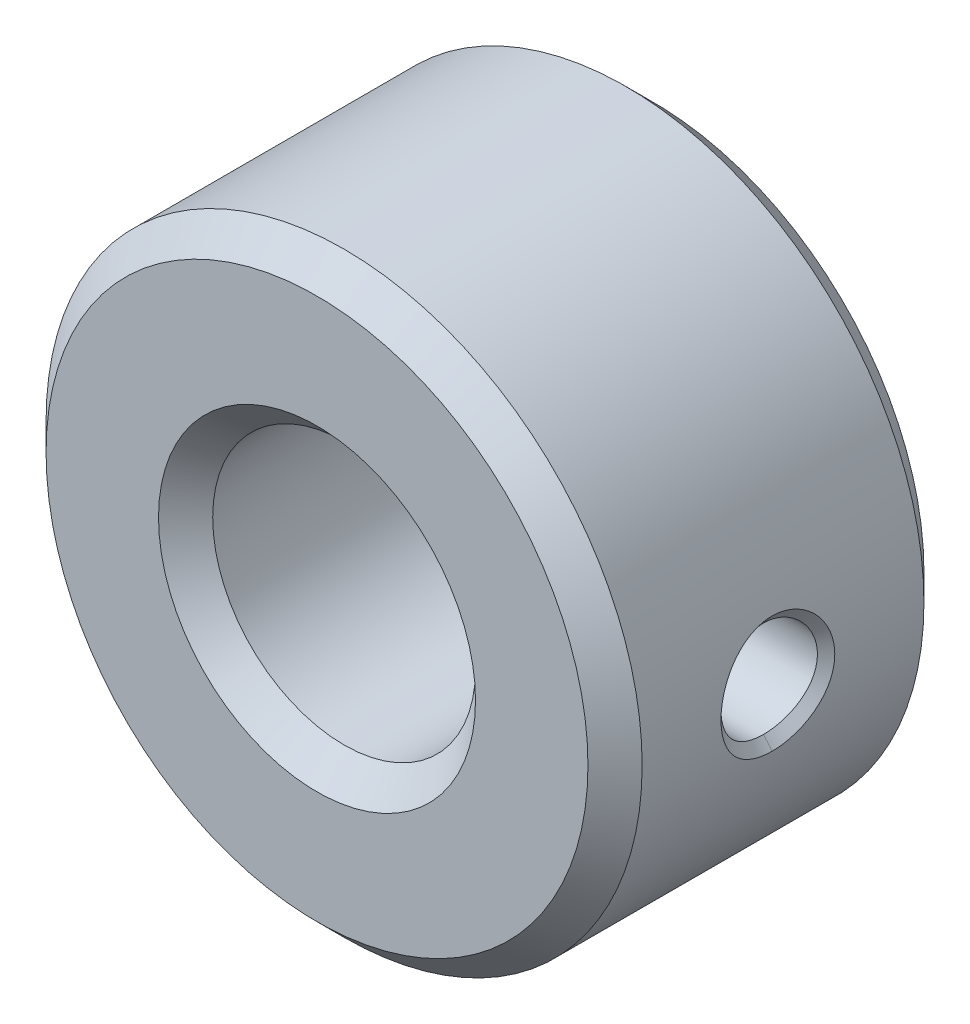
ISO-10303-21;
HEADER;
FILE_DESCRIPTION(('STEP AP214'),'2;1');
FILE_NAME('part.step','',(''),(''),'','','');
FILE_SCHEMA(('AUTOMOTIVE_DESIGN { 1 0 10303 214 1 1 1 1 }'));
ENDSEC;
DATA;
#1=APPLICATION_CONTEXT('core data for automotive mechanical design processes');
#2=APPLICATION_PROTOCOL_DEFINITION('international standard','automotive_design',2000,#1);
#3=PRODUCT_CONTEXT('',#1,'mechanical');
#4=PRODUCT('Part','Part','',(#3));
#5=PRODUCT_RELATED_PRODUCT_CATEGORY('part','',(#4));
#6=PRODUCT_DEFINITION_FORMATION('','',#4);
#7=PRODUCT_DEFINITION_CONTEXT('part definition',#1,'design');
#8=PRODUCT_DEFINITION('design','',#6,#7);
#9=PRODUCT_DEFINITION_SHAPE('','',#8);
#10=(LENGTH_UNIT() NAMED_UNIT(*) SI_UNIT(.MILLI.,.METRE.));
#11=(NAMED_UNIT(*) PLANE_ANGLE_UNIT() SI_UNIT($,.RADIAN.));
#12=(NAMED_UNIT(*) SI_UNIT($,.STERADIAN.) SOLID_ANGLE_UNIT());
#13=UNCERTAINTY_MEASURE_WITH_UNIT(LENGTH_MEASURE(1.E-05),#10,'distance_accuracy_value','');
#14=(GEOMETRIC_REPRESENTATION_CONTEXT(3) GLOBAL_UNCERTAINTY_ASSIGNED_CONTEXT((#13)) GLOBAL_UNIT_ASSIGNED_CONTEXT((#10,
#11,#12)) REPRESENTATION_CONTEXT('',''));
#15=CARTESIAN_POINT('',(0.,0.,0.));
#16=DIRECTION('',(0.,0.,1.));
#17=DIRECTION('',(1.,0.,0.));
#18=AXIS2_PLACEMENT_3D('',#15,#16,#17);
#19=CARTESIAN_POINT('',(0.,0.,-3.1));
#20=DIRECTION('',(0.,0.,1.));
#21=DIRECTION('',(1.,0.,0.));
#22=AXIS2_PLACEMENT_3D('',#19,#20,#21);
#23=CYLINDRICAL_SURFACE('',#22,2.425);
#24=CARTESIAN_POINT('',(2.25577591972252,-0.89,0.0953200000000005));
#25=CARTESIAN_POINT('',(2.2557778747135,-0.889997952105927,0.0472121284372866));
#26=CARTESIAN_POINT('',(2.2573336628656,-0.886082443044284,-0.000918013423561213));
#27=CARTESIAN_POINT('',(2.26335774314169,-0.870576091211679,-0.0957585384231379));
#28=CARTESIAN_POINT('',(2.26782861144726,-0.858978459274362,-0.142467627464479));
#29=CARTESIAN_POINT('',(2.27910587760253,-0.828589840392699,-0.233031266981017));
#30=CARTESIAN_POINT('',(2.28590605498247,-0.809817997036856,-0.276893053880208));
#31=CARTESIAN_POINT('',(2.30106710042008,-0.765674710388044,-0.360852562370003));
#32=CARTESIAN_POINT('',(2.30942814512694,-0.74030251998115,-0.400949857146274));
#33=CARTESIAN_POINT('',(2.32721519055579,-0.682385097408746,-0.478159693104952));
#34=CARTESIAN_POINT('',(2.33667160730512,-0.649577141904311,-0.515068204585635));
#35=CARTESIAN_POINT('',(2.35533134910262,-0.578269858420938,-0.583008887782421));
#36=CARTESIAN_POINT('',(2.36453457707563,-0.539768382586325,-0.614038831713317));
#37=CARTESIAN_POINT('',(2.3820120503789,-0.456623545441463,-0.670314631374832));
#38=CARTESIAN_POINT('',(2.39024598024664,-0.411820284790193,-0.695337673364168));
#39=CARTESIAN_POINT('',(2.40448142441839,-0.318309251862474,-0.737386387492664));
#40=CARTESIAN_POINT('',(2.41048563882434,-0.269606289475459,-0.754421739037993));
#41=CARTESIAN_POINT('',(2.41828303354208,-0.183924390532801,-0.776251841375847));
#42=CARTESIAN_POINT('',(2.4207872565042,-0.147531869149624,-0.783146950481622));
#43=CARTESIAN_POINT('',(2.42414623690833,-0.0740972005668482,-0.792361558430149));
#44=CARTESIAN_POINT('',(2.42500115540866,-0.0370551171549648,-0.794681504048455));
#45=CARTESIAN_POINT('',(2.42499849611614,0.0482310674603011,-0.794678042325376));
#46=CARTESIAN_POINT('',(2.42354665623089,0.0964842163164086,-0.790743150833025));
#47=CARTESIAN_POINT('',(2.41789099053942,0.191580918467185,-0.775152782191003));
#48=CARTESIAN_POINT('',(2.41368490687215,0.238423282252123,-0.763490970610026));
#49=CARTESIAN_POINT('',(2.40297619800644,0.329270126269513,-0.732915028909182));
#50=CARTESIAN_POINT('',(2.39647873654643,0.373280726487194,-0.714017197389408));
#51=CARTESIAN_POINT('',(2.38183799622199,0.457495538090783,-0.669576202852585));
#52=CARTESIAN_POINT('',(2.37369459750738,0.497699471978153,-0.644032555876493));
#53=CARTESIAN_POINT('',(2.35623263593283,0.574816493773327,-0.585930333257199));
#54=CARTESIAN_POINT('',(2.34688179320046,0.611553358894033,-0.553147647484306));
#55=CARTESIAN_POINT('',(2.32821947046306,0.679155042705736,-0.481965925989142));
#56=CARTESIAN_POINT('',(2.31890801082898,0.710017117373966,-0.443564280477424));
#57=CARTESIAN_POINT('',(2.30100566474101,0.766092253196574,-0.360534048018651));
#58=CARTESIAN_POINT('',(2.29245354087851,0.791057690687543,-0.315729200317147));
#59=CARTESIAN_POINT('',(2.27755071079869,0.832999305395897,-0.222217712328498));
#60=CARTESIAN_POINT('',(2.27119719131533,0.849985702374127,-0.173516157184417));
#61=CARTESIAN_POINT('',(2.26292991501722,0.871701977532608,-0.0879570383331331));
#62=CARTESIAN_POINT('',(2.26026606104807,0.878547855983707,-0.0516960336554407));
#63=CARTESIAN_POINT('',(2.25668842536757,0.887697361764628,0.021478996454921));
#64=CARTESIAN_POINT('',(2.25577441909339,0.890001571940516,0.0583929374807245));
#65=CARTESIAN_POINT('',(2.2557778747135,0.889997952105927,0.143427871562714));
#66=CARTESIAN_POINT('',(2.2573336628656,0.886082443044284,0.191558013423562));
#67=CARTESIAN_POINT('',(2.26335774314169,0.870576091211679,0.286398538423139));
#68=CARTESIAN_POINT('',(2.26782861144726,0.858978459274362,0.33310762746448));
#69=CARTESIAN_POINT('',(2.27910587760253,0.828589840392699,0.423671266981018));
#70=CARTESIAN_POINT('',(2.28590605498247,0.809817997036856,0.467533053880209));
#71=CARTESIAN_POINT('',(2.30106710042008,0.765674710388044,0.551492562370004));
#72=CARTESIAN_POINT('',(2.30942814512694,0.74030251998115,0.591589857146275));
#73=CARTESIAN_POINT('',(2.32721519055579,0.682385097408746,0.668799693104953));
#74=CARTESIAN_POINT('',(2.33667160730512,0.649577141904311,0.705708204585636));
#75=CARTESIAN_POINT('',(2.35533134910262,0.578269858420938,0.773648887782422));
#76=CARTESIAN_POINT('',(2.36453457707563,0.539768382586325,0.804678831713318));
#77=CARTESIAN_POINT('',(2.3820120503789,0.456623545441463,0.860954631374834));
#78=CARTESIAN_POINT('',(2.39024598024664,0.411820284790192,0.885977673364169));
#79=CARTESIAN_POINT('',(2.40448142441839,0.318309251862473,0.928026387492665));
#80=CARTESIAN_POINT('',(2.41048563882434,0.269606289475458,0.945061739037994));
#81=CARTESIAN_POINT('',(2.41828303354208,0.1839243905328,0.966891841375848));
#82=CARTESIAN_POINT('',(2.4207872565042,0.147531869149623,0.973786950481623));
#83=CARTESIAN_POINT('',(2.42414623690833,0.0740972005668475,0.98300155843015));
#84=CARTESIAN_POINT('',(2.42500115540866,0.0370551171549642,0.985321504048456));
#85=CARTESIAN_POINT('',(2.42499849611614,-0.0482310674603018,0.985318042325378));
#86=CARTESIAN_POINT('',(2.42354665623089,-0.0964842163164092,0.981383150833026));
#87=CARTESIAN_POINT('',(2.41789099053942,-0.191580918467186,0.965792782191004));
#88=CARTESIAN_POINT('',(2.41368490687215,-0.238423282252124,0.954130970610027));
#89=CARTESIAN_POINT('',(2.40297619800644,-0.329270126269514,0.923555028909183));
#90=CARTESIAN_POINT('',(2.39647873654643,-0.373280726487195,0.904657197389409));
#91=CARTESIAN_POINT('',(2.38183799622199,-0.457495538090784,0.860216202852586));
#92=CARTESIAN_POINT('',(2.37369459750738,-0.497699471978153,0.834672555876494));
#93=CARTESIAN_POINT('',(2.35623263593283,-0.574816493773327,0.776570333257199));
#94=CARTESIAN_POINT('',(2.34688179320046,-0.611553358894033,0.743787647484307));
#95=CARTESIAN_POINT('',(2.32821947046306,-0.679155042705737,0.672605925989142));
#96=CARTESIAN_POINT('',(2.31890801082898,-0.710017117373967,0.634204280477424));
#97=CARTESIAN_POINT('',(2.30100566474101,-0.766092253196575,0.551174048018651));
#98=CARTESIAN_POINT('',(2.29245354087851,-0.791057690687543,0.506369200317147));
#99=CARTESIAN_POINT('',(2.27755071079869,-0.832999305395897,0.412857712328498));
#100=CARTESIAN_POINT('',(2.27119719131533,-0.849985702374127,0.364156157184417));
#101=CARTESIAN_POINT('',(2.26292991501722,-0.871701977532608,0.278597038333133));
#102=CARTESIAN_POINT('',(2.26026606104807,-0.878547855983707,0.242336033655441));
#103=CARTESIAN_POINT('',(2.25668842536757,-0.887697361764628,0.169161003545079));
#104=CARTESIAN_POINT('',(2.25577441909338,-0.890001571940516,0.132247062519276));
#105=CARTESIAN_POINT('',(2.25577591972252,-0.89,0.0953200000000005));
#106=B_SPLINE_CURVE_WITH_KNOTS('',3,(#24,#25,#26,#27,#28,#29,#30,#31,#32,#33,#34,#35,#36,#37,
#38,#39,#40,#41,#42,#43,#44,#45,#46,#47,#48,#49,#50,#51,#52,#53,#54,#55,#56,#57,#58,#59,#60,#61,
#62,#63,#64,#65,#66,#67,#68,#69,#70,#71,#72,#73,#74,#75,#76,#77,#78,#79,#80,#81,#82,#83,#84,#85,
#86,#87,#88,#89,#90,#91,#92,#93,#94,#95,#96,#97,#98,#99,#100,#101,#102,#103,#104,#105),
.UNSPECIFIED.,.T.,.F.,(4,2,2,2,2,2,2,2,2,2,2,2,2,2,2,2,2,2,2,2,2,2,2,2,2,2,2,2,2,2,2,2,2,2,2,2,
2,2,2,2,4),(0.,0.144182771380857,0.288493136293094,0.432421083644349,0.576365329744363,
0.726533705871717,0.876758877568397,1.03190590881317,1.18686444537906,1.29793313085245,
1.40899096966837,1.55354423321698,1.69821614656377,1.84256409598708,1.98692256000542,
2.13660896991472,2.2863651253657,2.44159341893512,2.5966223462939,2.70730962986905,
2.81798270768424,2.96216547906509,3.10647584397733,3.25040379132858,3.3943480374286,
3.54451641355595,3.69474158525263,3.8498886164974,4.0048471530633,4.11591583853668,
4.22697367735261,4.37152694090121,4.516198854248,4.66054680367132,4.80490526768966,
4.95459167759896,5.10434783304994,5.25957612661936,5.41460505397813,5.52529233755328,
5.63596541536847),.UNSPECIFIED.);
#107=CARTESIAN_POINT('',(2.25577591972252,-0.89,0.0953200000000005));
#108=VERTEX_POINT('',#107);
#109=EDGE_CURVE('E22',#108,#108,#106,.T.);
#110=ORIENTED_EDGE('',*,*,#109,.T.);
#111=EDGE_LOOP('',(#110));
#112=FACE_BOUND('',#111,.T.);
#113=CARTESIAN_POINT('',(0.,0.,2.59999999980209));
#114=DIRECTION('',(0.,0.,1.));
#115=DIRECTION('',(0.,-1.,0.));
#116=AXIS2_PLACEMENT_3D('',#113,#114,#115);
#117=CIRCLE('',#116,2.42499999984602);
#118=CARTESIAN_POINT('',(0.,-2.42499999984602,2.59999999980209));
#119=VERTEX_POINT('',#118);
#120=EDGE_CURVE('E127',#119,#119,#117,.T.);
#121=ORIENTED_EDGE('',*,*,#120,.T.);
#122=EDGE_LOOP('',(#121));
#123=FACE_BOUND('',#122,.T.);
#124=CARTESIAN_POINT('',(0.,0.,-2.59999999974525));
#125=DIRECTION('',(0.,0.,-1.));
#126=DIRECTION('',(0.,-1.,0.));
#127=AXIS2_PLACEMENT_3D('',#124,#125,#126);
#128=CIRCLE('',#127,2.42499999978918);
#129=CARTESIAN_POINT('',(0.,-2.42499999978918,-2.59999999974525));
#130=VERTEX_POINT('',#129);
#131=EDGE_CURVE('E124',#130,#130,#128,.T.);
#132=ORIENTED_EDGE('',*,*,#131,.T.);
#133=EDGE_LOOP('',(#132));
#134=FACE_BOUND('',#133,.T.);
#135=ADVANCED_FACE('F15',(#112,#123,#134),#23,.F.);
#136=CARTESIAN_POINT('',(0.,0.,3.09999999967658));
#137=DIRECTION('',(0.,0.,1.));
#138=DIRECTION('',(1.,0.,0.));
#139=AXIS2_PLACEMENT_3D('',#136,#137,#138);
#140=CONICAL_SURFACE('',#139,2.92499999972051,0.785398163397448);
#141=ORIENTED_EDGE('',*,*,#120,.F.);
#142=EDGE_LOOP('',(#141));
#143=FACE_BOUND('',#142,.T.);
#144=CARTESIAN_POINT('',(0.,0.,3.09999999967658));
#145=DIRECTION('',(0.,0.,1.));
#146=DIRECTION('',(1.,0.,0.));
#147=AXIS2_PLACEMENT_3D('',#144,#145,#146);
#148=CIRCLE('',#147,2.92499999972051);
#149=CARTESIAN_POINT('',(2.92499999972051,0.,3.09999999967658));
#150=VERTEX_POINT('',#149);
#151=EDGE_CURVE('E55',#150,#150,#148,.F.);
#152=ORIENTED_EDGE('',*,*,#151,.F.);
#153=EDGE_LOOP('',(#152));
#154=FACE_BOUND('',#153,.T.);
#155=ADVANCED_FACE('F83',(#143,#154),#140,.F.);
#156=CARTESIAN_POINT('',(0.,0.,0.0953200000000005));
#157=DIRECTION('',(1.,0.,0.));
#158=DIRECTION('',(0.,0.,-1.));
#159=AXIS2_PLACEMENT_3D('',#156,#157,#158);
#160=CYLINDRICAL_SURFACE('',#159,0.89);
#161=ORIENTED_EDGE('',*,*,#109,.F.);
#162=EDGE_LOOP('',(#161));
#163=FACE_BOUND('',#162,.T.);
#164=CARTESIAN_POINT('',(5.23565016326293,0.889999999999989,0.0953198583494335));
#165=CARTESIAN_POINT('',(5.23560452403956,0.890001600792686,0.116507916397975));
#166=CARTESIAN_POINT('',(5.2357892935373,0.88924343415248,0.137694610712296));
#167=CARTESIAN_POINT('',(5.23655053651843,0.886219875329838,0.179949471805866));
#168=CARTESIAN_POINT('',(5.2371269385611,0.883954758043514,0.201017659496202));
#169=CARTESIAN_POINT('',(5.23860201653778,0.87793102977673,0.242917564855536));
#170=CARTESIAN_POINT('',(5.23950053928389,0.874173128613836,0.263749390079377));
#171=CARTESIAN_POINT('',(5.24159083582016,0.865186796852072,0.305079781779492));
#172=CARTESIAN_POINT('',(5.24278264158463,0.859958205906736,0.325578311659292));
#173=CARTESIAN_POINT('',(5.24566010333217,0.847157373886779,0.369211023081091));
#174=CARTESIAN_POINT('',(5.24739323407983,0.839350014340608,0.392273719631563));
#175=CARTESIAN_POINT('',(5.25123735018715,0.821888949233477,0.437651119948409));
#176=CARTESIAN_POINT('',(5.2533483701705,0.812235074482002,0.459965754951835));
#177=CARTESIAN_POINT('',(5.26008568137127,0.780592796336523,0.525585404205723));
#178=CARTESIAN_POINT('',(5.26511797494229,0.755916585783681,0.567590422928508));
#179=CARTESIAN_POINT('',(5.27594578001864,0.699492433478825,0.647835371019184));
#180=CARTESIAN_POINT('',(5.28175582413784,0.667598893060859,0.685970289359778));
#181=CARTESIAN_POINT('',(5.29336376849392,0.597910922726647,0.756422444120198));
#182=CARTESIAN_POINT('',(5.29916166670113,0.560115575654196,0.788738774632827));
#183=CARTESIAN_POINT('',(5.31024003436852,0.478962243992053,0.847140974967978));
#184=CARTESIAN_POINT('',(5.31551061357138,0.435524147910731,0.873117571489121));
#185=CARTESIAN_POINT('',(5.32477172388329,0.34476699628366,0.917380463044494));
#186=CARTESIAN_POINT('',(5.32876243733041,0.297448494773185,0.935667853649062));
#187=CARTESIAN_POINT('',(5.33502209795272,0.200968123467343,0.963767445223606));
#188=CARTESIAN_POINT('',(5.33731434120402,0.151841283176582,0.973694583591241));
#189=CARTESIAN_POINT('',(5.3399660918202,0.0525687813736425,0.985169532784457));
#190=CARTESIAN_POINT('',(5.34032584762847,0.00242325165774044,0.986718420730219));
#191=CARTESIAN_POINT('',(5.3391033984561,-0.096318325096324,0.981443684418585));
#192=CARTESIAN_POINT('',(5.33756261969331,-0.144924556177289,0.974798664916717));
#193=CARTESIAN_POINT('',(5.33276172448979,-0.24030614763226,0.953655279340688));
#194=CARTESIAN_POINT('',(5.32950158737399,-0.287081485982756,0.939156818829875));
#195=CARTESIAN_POINT('',(5.32164887449881,-0.377699086053812,0.902684812004627));
#196=CARTESIAN_POINT('',(5.31705138344206,-0.421529780050925,0.880683637940292));
#197=CARTESIAN_POINT('',(5.30692024583885,-0.504919735585443,0.829854811072436));
#198=CARTESIAN_POINT('',(5.30138645904933,-0.544478355773872,0.801026135352554));
#199=CARTESIAN_POINT('',(5.28996298082719,-0.619180667663687,0.73657302243539));
#200=CARTESIAN_POINT('',(5.28406802009765,-0.654201216818127,0.700806943687924));
#201=CARTESIAN_POINT('',(5.27257580470748,-0.71779985760885,0.623858210781763));
#202=CARTESIAN_POINT('',(5.26697860409038,-0.746376782753427,0.582674578014455));
#203=CARTESIAN_POINT('',(5.25934262657895,-0.783884007939114,0.517531994297855));
#204=CARTESIAN_POINT('',(5.2569145255051,-0.795534529186318,0.495145460847579));
#205=CARTESIAN_POINT('',(5.25234433729135,-0.816905744330126,0.449441728613217));
#206=CARTESIAN_POINT('',(5.25020227308984,-0.826626283484431,0.426124455384053));
#207=CARTESIAN_POINT('',(5.2444169038702,-0.852745899912388,0.355053447605586));
#208=CARTESIAN_POINT('',(5.24140331940843,-0.866153896243074,0.306092061521349));
#209=CARTESIAN_POINT('',(5.23807692678063,-0.880195870112014,0.229815013941323));
#210=CARTESIAN_POINT('',(5.23715994387374,-0.883870832141845,0.203037773898954));
#211=CARTESIAN_POINT('',(5.23591905480277,-0.888770696634115,0.149287155044584));
#212=CARTESIAN_POINT('',(5.23559426498789,-0.889999249799104,0.122314128863687));
#213=CARTESIAN_POINT('',(5.23561912172928,-0.889999999999983,0.0953198228718334));
#214=B_SPLINE_CURVE_WITH_KNOTS('',3,(#164,#165,#166,#167,#168,#169,#170,#171,#172,#173,#174,
#175,#176,#177,#178,#179,#180,#181,#182,#183,#184,#185,#186,#187,#188,#189,#190,#191,#192,#193,
#194,#195,#196,#197,#198,#199,#200,#201,#202,#203,#204,#205,#206,#207,#208,#209,#210,#211,#212,
#213),.UNSPECIFIED.,.F.,.F.,(4,2,2,2,2,2,2,2,2,2,2,2,2,2,2,2,2,2,2,2,2,2,2,2,4),(0.,
0.0635467397028313,0.127081890463691,0.190586866403611,0.254098768854017,0.327238030375669,
0.400383996636221,0.546600787714111,0.696082383708099,0.845587232694365,0.997511158030909,
1.14941342966268,1.29919156694917,1.44895044808062,1.59550192310086,1.74205516042349,
1.88915399485329,2.0362748820204,2.18679541227289,2.33734316947641,2.41332112567347,
2.489305171181,2.64096917350473,2.72200159238603,2.80291299812895),.UNSPECIFIED.);
#215=CARTESIAN_POINT('',(5.23571477536758,0.890030574846656,0.0953200205408379));
#216=VERTEX_POINT('',#215);
#217=CARTESIAN_POINT('',(5.23571564199098,-0.890029864942783,0.095319980030967));
#218=VERTEX_POINT('',#217);
#219=EDGE_CURVE('E51',#216,#218,#214,.T.);
#220=ORIENTED_EDGE('',*,*,#219,.T.);
#221=CARTESIAN_POINT('',(5.23565273355406,-0.88999999999999,0.0953201340981246));
#222=CARTESIAN_POINT('',(5.2356081191779,-0.890001601662795,0.0741319449724543));
#223=CARTESIAN_POINT('',(5.2357927197152,-0.889243424412201,0.0529450971076244));
#224=CARTESIAN_POINT('',(5.2365527146395,-0.886219819568686,0.0106899046965232));
#225=CARTESIAN_POINT('',(5.23712803782334,-0.883954666600336,-0.0103784607361283));
#226=CARTESIAN_POINT('',(5.23860152507766,-0.877930840318779,-0.0522787175165793));
#227=CARTESIAN_POINT('',(5.23949953569596,-0.874172876813675,-0.0731107164179089));
#228=CARTESIAN_POINT('',(5.2415895581064,-0.865186406570132,-0.114441408479389));
#229=CARTESIAN_POINT('',(5.24278160192599,-0.859957739627087,-0.134940065070894));
#230=CARTESIAN_POINT('',(5.24565978212489,-0.8471564782189,-0.17857388723174));
#231=CARTESIAN_POINT('',(5.24739343017923,-0.839348692698201,-0.201637542543449));
#232=CARTESIAN_POINT('',(5.25123804970775,-0.821886603153753,-0.247016827859321));
#233=CARTESIAN_POINT('',(5.25334905583254,-0.812232129553611,-0.269332388946665));
#234=CARTESIAN_POINT('',(5.26008631153763,-0.78058781399428,-0.334954686214377));
#235=CARTESIAN_POINT('',(5.26511854930864,-0.755909924633721,-0.376961294345988));
#236=CARTESIAN_POINT('',(5.27594717831447,-0.699482822943157,-0.45720760693726));
#237=CARTESIAN_POINT('',(5.28175810643653,-0.667588206045277,-0.495342433078179));
#238=CARTESIAN_POINT('',(5.29336667269976,-0.597897947290804,-0.56579422245701));
#239=CARTESIAN_POINT('',(5.29916430863721,-0.560101389912227,-0.598110281397592));
#240=CARTESIAN_POINT('',(5.31024213500267,-0.478946450761735,-0.656511021082782));
#241=CARTESIAN_POINT('',(5.31551244932531,-0.435508059334242,-0.682486561919589));
#242=CARTESIAN_POINT('',(5.32477314674319,-0.344750518471583,-0.726747355653309));
#243=CARTESIAN_POINT('',(5.32876371197961,-0.297431922494096,-0.745033703035452));
#244=CARTESIAN_POINT('',(5.33502263863475,-0.200950747209862,-0.773131497149863));
#245=CARTESIAN_POINT('',(5.33731427593175,-0.151823154231813,-0.783057747181065));
#246=CARTESIAN_POINT('',(5.3399659253713,-0.0525493324908701,-0.79453071285806));
#247=CARTESIAN_POINT('',(5.34032618590962,-0.00240323555125213,-0.796078506063515));
#248=CARTESIAN_POINT('',(5.33910357406589,0.0963390190776107,-0.790801448350575));
#249=CARTESIAN_POINT('',(5.33756216196196,0.14494536747639,-0.784155245106057));
#250=CARTESIAN_POINT('',(5.33276018362391,0.240326951043271,-0.763009473668596));
#251=CARTESIAN_POINT('',(5.32949959684496,0.287102164321394,-0.748509811623593));
#252=CARTESIAN_POINT('',(5.3216473224865,0.377718734928989,-0.712035582614168));
#253=CARTESIAN_POINT('',(5.3170507439691,0.421548570278406,-0.690033497798255));
#254=CARTESIAN_POINT('',(5.30691807255764,0.504936445545429,-0.639203311619828));
#255=CARTESIAN_POINT('',(5.3013818388236,0.54449384363336,-0.610374186731811));
#256=CARTESIAN_POINT('',(5.28995856724095,0.6191944836552,-0.545919654139822));
#257=CARTESIAN_POINT('',(5.28406637824307,0.65421453436417,-0.510152534285208));
#258=CARTESIAN_POINT('',(5.27257537025733,0.717811686262705,-0.433202196362953));
#259=CARTESIAN_POINT('',(5.26697660447939,0.746387621946218,-0.39201800067249));
#260=CARTESIAN_POINT('',(5.25934039795153,0.783893403774999,-0.32687453838918));
#261=CARTESIAN_POINT('',(5.25691258115473,0.795543443319,-0.304487719315481));
#262=CARTESIAN_POINT('',(5.25234258645459,0.816913654168023,-0.258783488267251));
#263=CARTESIAN_POINT('',(5.25020043140722,0.826633671081053,-0.235466002023128));
#264=CARTESIAN_POINT('',(5.24441584194565,0.852751712171623,-0.164394355735249));
#265=CARTESIAN_POINT('',(5.24140417766462,0.866158636243594,-0.115432558594574));
#266=CARTESIAN_POINT('',(5.23807690113893,0.88019829857984,-0.0391584692250785));
#267=CARTESIAN_POINT('',(5.23715890500629,0.883872350441574,-0.0123845001819756));
#268=CARTESIAN_POINT('',(5.23591628378073,0.888770995879584,0.0413594991750617));
#269=CARTESIAN_POINT('',(5.23559077415827,0.889999241085391,0.0683291767745628));
#270=CARTESIAN_POINT('',(5.23561599663768,0.88999999999998,0.0953201848518794));
#271=B_SPLINE_CURVE_WITH_KNOTS('',3,(#221,#222,#223,#224,#225,#226,#227,#228,#229,#230,#231,
#232,#233,#234,#235,#236,#237,#238,#239,#240,#241,#242,#243,#244,#245,#246,#247,#248,#249,#250,
#251,#252,#253,#254,#255,#256,#257,#258,#259,#260,#261,#262,#263,#264,#265,#266,#267,#268,#269,
#270),.UNSPECIFIED.,.F.,.F.,(4,2,2,2,2,2,2,2,2,2,2,2,2,2,2,2,2,2,2,2,2,2,2,2,4),(0.,
0.0635471908291439,0.127082804271099,0.190588243612382,0.25410060331997,0.327243094361357,
0.400392305107917,0.546615592264555,0.696099319128896,0.845606257315458,0.99752926131332,
1.14943063315713,1.29921036785197,1.44897083880423,1.59552315578647,1.74207722416774,
1.8891747202808,2.03629428356507,2.18681504247828,2.33736300332748,2.41334097038354,
2.48932501284402,2.64098906001569,2.72201154429013,2.80291296969365),.UNSPECIFIED.);
#272=EDGE_CURVE('E50',#218,#216,#271,.T.);
#273=ORIENTED_EDGE('',*,*,#272,.T.);
#274=EDGE_LOOP('',(#220,#273));
#275=FACE_BOUND('',#274,.T.);
#276=ADVANCED_FACE('F53',(#163,#275),#160,.F.);
#277=CARTESIAN_POINT('',(0.,0.,-3.09999999984711));
#278=DIRECTION('',(0.,0.,-1.));
#279=DIRECTION('',(-1.,0.,0.));
#280=AXIS2_PLACEMENT_3D('',#277,#278,#279);
#281=CONICAL_SURFACE('',#280,2.9249999998342,0.785398163340605);
#282=ORIENTED_EDGE('',*,*,#131,.F.);
#283=EDGE_LOOP('',(#282));
#284=FACE_BOUND('',#283,.T.);
#285=CARTESIAN_POINT('',(0.,0.,-3.09999999984711));
#286=DIRECTION('',(0.,0.,-1.));
#287=DIRECTION('',(-1.,0.,0.));
#288=AXIS2_PLACEMENT_3D('',#285,#286,#287);
#289=CIRCLE('',#288,2.9249999998342);
#290=CARTESIAN_POINT('',(-2.9249999998342,0.,-3.09999999984711));
#291=VERTEX_POINT('',#290);
#292=EDGE_CURVE('E69',#291,#291,#289,.T.);
#293=ORIENTED_EDGE('',*,*,#292,.T.);
#294=EDGE_LOOP('',(#293));
#295=FACE_BOUND('',#294,.T.);
#296=ADVANCED_FACE('F82',(#284,#295),#281,.F.);
#297=CARTESIAN_POINT('',(0.,0.,3.1));
#298=DIRECTION('',(0.,0.,1.));
#299=DIRECTION('',(1.,0.,0.));
#300=AXIS2_PLACEMENT_3D('',#297,#298,#299);
#301=PLANE('',#300);
#302=ORIENTED_EDGE('',*,*,#151,.T.);
#303=EDGE_LOOP('',(#302));
#304=FACE_BOUND('',#303,.T.);
#305=CARTESIAN_POINT('',(0.,0.,3.10000000001764));
#306=DIRECTION('',(0.,0.,-1.));
#307=DIRECTION('',(-1.,0.,0.));
#308=AXIS2_PLACEMENT_3D('',#305,#306,#307);
#309=CIRCLE('',#308,4.99999999999545);
#310=CARTESIAN_POINT('',(-4.99999999999545,0.,3.10000000001764));
#311=VERTEX_POINT('',#310);
#312=EDGE_CURVE('E168',#311,#311,#309,.T.);
#313=ORIENTED_EDGE('',*,*,#312,.F.);
#314=EDGE_LOOP('',(#313));
#315=FACE_BOUND('',#314,.T.);
#316=ADVANCED_FACE('F96',(#304,#315),#301,.T.);
#317=CARTESIAN_POINT('',(5.39438331332938,-1.08246390021452,0.0521117847945343));
#318=CARTESIAN_POINT('',(5.3928141771159,-1.08055052218359,0.0521775388626719));
#319=CARTESIAN_POINT('',(5.23590055576828,-0.88921271909102,0.0587529456764288));
#320=CARTESIAN_POINT('',(5.23431572819266,-0.887280207279785,0.0588193572852478));
#321=CARTESIAN_POINT('',(5.39372794105031,-1.08541840439062,0.114822838799645));
#322=CARTESIAN_POINT('',(5.39215899547371,-1.08349980393761,0.114793159467017));
#323=CARTESIAN_POINT('',(5.23526443781356,-0.891639758636154,0.111825226204304));
#324=CARTESIAN_POINT('',(5.23367980278119,-0.88970197217861,0.111795250078351));
#325=CARTESIAN_POINT('',(5.39516225852378,-1.07880600662446,0.24651643247674));
#326=CARTESIAN_POINT('',(5.39359289572813,-1.0768990943364,0.24628634242382));
#327=CARTESIAN_POINT('',(5.23665661616284,-0.886207865529887,0.223277337131754));
#328=CARTESIAN_POINT('',(5.23507155973923,-0.884281884118941,0.223044946178304));
#329=CARTESIAN_POINT('',(5.40515208436488,-1.02798084409089,0.449425410394848));
#330=CARTESIAN_POINT('',(5.40357981569536,-1.02616377105695,0.448886534369253));
#331=CARTESIAN_POINT('',(5.24635294874346,-0.844456467662706,0.39499893180973));
#332=CARTESIAN_POINT('',(5.24476495738725,-0.842621223898424,0.394454667023879));
#333=CARTESIAN_POINT('',(5.4225834233729,-0.932906768143791,0.644257106117259));
#334=CARTESIAN_POINT('',(5.42100608421734,-0.931257749349987,0.643421736090813));
#335=CARTESIAN_POINT('',(5.2632721686614,-0.766355869969576,0.559884733446215));
#336=CARTESIAN_POINT('',(5.26167905611428,-0.764690360987834,0.559041009719504));
#337=CARTESIAN_POINT('',(5.44403011697748,-0.799721373970264,0.815254885279539));
#338=CARTESIAN_POINT('',(5.44244653933614,-0.798307775505213,0.814159291599583));
#339=CARTESIAN_POINT('',(5.28408877520217,-0.656947929000106,0.704599923603991));
#340=CARTESIAN_POINT('',(5.28248936178441,-0.655520194550405,0.703493373987236));
#341=CARTESIAN_POINT('',(5.46587974994025,-0.635494944500499,0.955918010515052));
#342=CARTESIAN_POINT('',(5.46428981660479,-0.634371634923772,0.9546083563219));
#343=CARTESIAN_POINT('',(5.3052964830583,-0.52204067725113,0.823642937006676));
#344=CARTESIAN_POINT('',(5.30369065038948,-0.520906134578636,0.822320186271592));
#345=CARTESIAN_POINT('',(5.48514712811286,-0.441981542427387,1.06353921898442));
#346=CARTESIAN_POINT('',(5.48355159021816,-0.441200289793292,1.06206578731883));
#347=CARTESIAN_POINT('',(5.32399780074792,-0.363075026383802,0.914722620760194));
#348=CARTESIAN_POINT('',(5.32238630747427,-0.362285961223366,0.913234454777952));
#349=CARTESIAN_POINT('',(5.49825109913203,-0.229979548376704,1.13049386632646));
#350=CARTESIAN_POINT('',(5.49665174951052,-0.229573033373904,1.12891854337879));
#351=CARTESIAN_POINT('',(5.33671678735988,-0.188921533093942,0.97138624861266));
#352=CARTESIAN_POINT('',(5.33510144424216,-0.188510952941114,0.969795172435522));
#353=CARTESIAN_POINT('',(5.50310491346582,-0.00818197545614145,1.1542775579122));
#354=CARTESIAN_POINT('',(5.50150415195061,-0.00816751288414783,1.15266604104933));
#355=CARTESIAN_POINT('',(5.34142800042943,-0.0067212556847856,0.991514354763195));
#356=CARTESIAN_POINT('',(5.33981123129907,-0.00670664848707204,0.989886722731705));
#357=CARTESIAN_POINT('',(5.49891053264356,0.213717078321933,1.13375423428184));
#358=CARTESIAN_POINT('',(5.49731099120383,0.213339309084165,1.13217394972085));
#359=CARTESIAN_POINT('',(5.33735684723123,0.175562385307421,0.974145493621337));
#360=CARTESIAN_POINT('',(5.3357413103771,0.175180838377276,0.972549406214732));
#361=CARTESIAN_POINT('',(5.48637133935845,0.426738111707203,1.06998303874575));
#362=CARTESIAN_POINT('',(5.48477544536109,0.425983803570241,1.06849980090415));
#363=CARTESIAN_POINT('',(5.32518604562575,0.350552989874055,0.920176016743887));
#364=CARTESIAN_POINT('',(5.32357419268842,0.349791138655723,0.918677946523868));
#365=CARTESIAN_POINT('',(5.46739082777377,0.622610022801042,0.964856649368367));
#366=CARTESIAN_POINT('',(5.46580045489095,0.621509488788568,0.963533392394692));
#367=CARTESIAN_POINT('',(5.30676316660835,0.511456087541137,0.831207695027198));
#368=CARTESIAN_POINT('',(5.30515688999669,0.510344548188538,0.829871205483786));
#369=CARTESIAN_POINT('',(5.4454759314506,0.789970345085322,0.82543144351331));
#370=CARTESIAN_POINT('',(5.44389193324592,0.788573982672618,0.82432036319267));
#371=CARTESIAN_POINT('',(5.28549211277823,0.64893774140217,0.713212331128619));
#372=CARTESIAN_POINT('',(5.28389227459151,0.647527415365338,0.712090140004772));
#373=CARTESIAN_POINT('',(5.42384768973207,0.925604742343819,0.655776323621604));
#374=CARTESIAN_POINT('',(5.42226998282249,0.923968630710931,0.654923423701617));
#375=CARTESIAN_POINT('',(5.26449929186495,0.760357467422221,0.569633431702863));
#376=CARTESIAN_POINT('',(5.26290580788628,0.758704994673005,0.568772002783676));
#377=CARTESIAN_POINT('',(5.4060764715949,1.02316088314019,0.462296564339345));
#378=CARTESIAN_POINT('',(5.40450393403654,1.02135232993531,0.461738101049397));
#379=CARTESIAN_POINT('',(5.24725017820053,0.840497009447022,0.405891772054517));
#380=CARTESIAN_POINT('',(5.24566191526658,0.83867037071009,0.405327724131669));
#381=CARTESIAN_POINT('',(5.39558352122724,1.07671838129213,0.260096597937237));
#382=CARTESIAN_POINT('',(5.39401403589329,1.07481515911923,0.259845841649418));
#383=CARTESIAN_POINT('',(5.23706550249795,0.884492941828656,0.234770212867437));
#384=CARTESIAN_POINT('',(5.23548032231066,0.882570687434021,0.234516949016739));
#385=CARTESIAN_POINT('',(5.39379493958567,1.08508157778491,0.128071251110454));
#386=CARTESIAN_POINT('',(5.39222597452031,1.08316357271122,0.128021410403383));
#387=CARTESIAN_POINT('',(5.23532946798441,0.891363065342393,0.123037339696304));
#388=CARTESIAN_POINT('',(5.2337448132684,0.889425880217968,0.122987000582162));
#389=CARTESIAN_POINT('',(5.39429096343839,1.08292538200111,0.0648992609376808));
#390=CARTESIAN_POINT('',(5.39272185408796,1.08101118824865,0.0649455550819676));
#391=CARTESIAN_POINT('',(5.23581091904477,0.88959181300278,0.0695749695106523));
#392=CARTESIAN_POINT('',(5.23422611860083,0.887658477312796,0.069621726596382));
#393=B_SPLINE_SURFACE_WITH_KNOTS('',3,1,((#317,#318,#319,#320),(#321,#322,#323,#324),(#325,#326,
#327,#328),(#329,#330,#331,#332),(#333,#334,#335,#336),(#337,#338,#339,#340),(#341,#342,#343,
#344),(#345,#346,#347,#348),(#349,#350,#351,#352),(#353,#354,#355,#356),(#357,#358,#359,#360),
(#361,#362,#363,#364),(#365,#366,#367,#368),(#369,#370,#371,#372),(#373,#374,#375,#376),(#377,
#378,#379,#380),(#381,#382,#383,#384),(#385,#386,#387,#388),(#389,#390,#391,#392)),
.UNSPECIFIED.,.F.,.F.,.F.,(4,1,1,1,1,1,1,1,1,1,1,1,1,1,1,1,4),(2,1,1,2),(0.,0.0625,0.125,0.1875,
0.25,0.3125,0.375,0.4375,0.5,0.5625,0.625,0.6875,0.75,0.8125,0.875,0.9375,1.),
(-0.010018262563471,-1.62337451794741E-05,1.00018664808397,1.01028869719045),.UNSPECIFIED.);
#394=CARTESIAN_POINT('',(5.23409843901628,0.888106014142553,0.0953198565894759));
#395=CARTESIAN_POINT('',(5.23568320080184,0.890040324575579,0.0953198563285456));
#396=CARTESIAN_POINT('',(5.39259030828342,1.08155620903366,0.0953198304938623));
#397=CARTESIAN_POINT('',(5.39415937935823,1.08347136787824,0.0953198302355155));
#398=B_SPLINE_CURVE_WITH_KNOTS('',1,(#394,#395,#396,#397),.UNSPECIFIED.,.F.,.F.,(2,1,1,2),
(-0.010018262563471,8.37865430034501E-05,1.00028666837216,1.01028869719045),.UNSPECIFIED.);
#399=CARTESIAN_POINT('',(5.39258524783302,1.08149616031381,0.0953200316426274));
#400=VERTEX_POINT('',#399);
#401=EDGE_CURVE('E41',#216,#400,#398,.T.);
#402=CARTESIAN_POINT('',(5.39259861726383,-1.08160998196402,0.0953197956826054));
#403=CARTESIAN_POINT('',(5.3925909561064,-1.08164022876892,0.123418494953653));
#404=CARTESIAN_POINT('',(5.39283129045612,-1.08044990946645,0.151508612140587));
#405=CARTESIAN_POINT('',(5.39377562770531,-1.07572985869192,0.207483588943008));
#406=CARTESIAN_POINT('',(5.39447960687162,-1.07220024696403,0.235368458990859));
#407=CARTESIAN_POINT('',(5.39631697547137,-1.06291312787763,0.29068930220325));
#408=CARTESIAN_POINT('',(5.39744945516252,-1.05716033995871,0.318126098817143));
#409=CARTESIAN_POINT('',(5.40011240211298,-1.04347240716981,0.372421657183518));
#410=CARTESIAN_POINT('',(5.40164285829869,-1.03553732302135,0.399280434996722));
#411=CARTESIAN_POINT('',(5.40680696837822,-1.00835633784305,0.478952529382114));
#412=CARTESIAN_POINT('',(5.41100583161144,-0.985770601394734,0.530644314320119));
#413=CARTESIAN_POINT('',(5.41804872933354,-0.946006170568364,0.604856659248419));
#414=CARTESIAN_POINT('',(5.42052202208425,-0.931760967456993,0.629052230430562));
#415=CARTESIAN_POINT('',(5.42566000058845,-0.901360831839317,0.676195135488876));
#416=CARTESIAN_POINT('',(5.42832468868525,-0.885205875949779,0.699142454076276));
#417=CARTESIAN_POINT('',(5.43668178808968,-0.832924722051335,0.767462606566736));
#418=CARTESIAN_POINT('',(5.44257048695013,-0.793884585145664,0.810632454758793));
#419=CARTESIAN_POINT('',(5.45423847099753,-0.709296884896054,0.890025715384086));
#420=CARTESIAN_POINT('',(5.46001772439589,-0.663747462781492,0.926247136702628));
#421=CARTESIAN_POINT('',(5.4710742040714,-0.565574430687341,0.992210063636132));
#422=CARTESIAN_POINT('',(5.47632438461332,-0.512749230942141,1.02165672547542));
#423=CARTESIAN_POINT('',(5.48550058834865,-0.402888941077698,1.07151195663302));
#424=CARTESIAN_POINT('',(5.48942658522389,-0.345853767312649,1.09192034631813));
#425=CARTESIAN_POINT('',(5.49558779618782,-0.228132221255706,1.12343706676874));
#426=CARTESIAN_POINT('',(5.49779308775894,-0.167400219937736,1.13438115419082));
#427=CARTESIAN_POINT('',(5.50015757141062,-0.0449233502598281,1.14610621609836));
#428=CARTESIAN_POINT('',(5.50031670484034,0.0168215470828435,1.14688689926124));
#429=CARTESIAN_POINT('',(5.49857307696191,0.139458898037195,1.13826138158483));
#430=CARTESIAN_POINT('',(5.49667389100523,0.200352644290675,1.12887284494747));
#431=CARTESIAN_POINT('',(5.49102730516879,0.319668916520591,1.10017893944116));
#432=CARTESIAN_POINT('',(5.48727985235866,0.378091371672577,1.08087328656684));
#433=CARTESIAN_POINT('',(5.47834971426488,0.490797692629237,1.03285956619655));
#434=CARTESIAN_POINT('',(5.4731674223718,0.545082687608505,1.00415407546546));
#435=CARTESIAN_POINT('',(5.46193884056489,0.648001977572546,0.938080970211504));
#436=CARTESIAN_POINT('',(5.45589254952818,0.696636265213279,0.90071334443093));
#437=CARTESIAN_POINT('',(5.44362877291889,0.786750041247692,0.818267948385224));
#438=CARTESIAN_POINT('',(5.43741148604504,0.828237458222052,0.773198834043979));
#439=CARTESIAN_POINT('',(5.42553004459459,0.902803066846853,0.676526232212197));
#440=CARTESIAN_POINT('',(5.41986573971629,0.93588354746158,0.624924529100355));
#441=CARTESIAN_POINT('',(5.40989948192698,0.991857479399552,0.5179076497114));
#442=CARTESIAN_POINT('',(5.40556762218208,1.01498009743876,0.462616463955759));
#443=CARTESIAN_POINT('',(5.40037260509084,1.04214090678827,0.377326149468401));
#444=CARTESIAN_POINT('',(5.3988583878859,1.04993912949721,0.348515119315435));
#445=CARTESIAN_POINT('',(5.39629180102611,1.0630522095698,0.290300177957536));
#446=CARTESIAN_POINT('',(5.39523948831283,1.06836676076249,0.260896194122917));
#447=CARTESIAN_POINT('',(5.39382938490463,1.07546012582008,0.208784589379945));
#448=CARTESIAN_POINT('',(5.3933658185296,1.07777985792907,0.1861520738095));
#449=CARTESIAN_POINT('',(5.3927488668337,1.08086091715424,0.140788167778964));
#450=CARTESIAN_POINT('',(5.39259533885163,1.08162296102776,0.118056827619737));
#451=CARTESIAN_POINT('',(5.3926056473316,1.0815749314625,0.0953198536344017));
#452=B_SPLINE_CURVE_WITH_KNOTS('',3,(#402,#403,#404,#405,#406,#407,#408,#409,#410,#411,#412,
#413,#414,#415,#416,#417,#418,#419,#420,#421,#422,#423,#424,#425,#426,#427,#428,#429,#430,#431,
#432,#433,#434,#435,#436,#437,#438,#439,#440,#441,#442,#443,#444,#445,#446,#447,#448,#449,#450,
#451),.UNSPECIFIED.,.F.,.F.,(4,2,2,2,2,2,2,2,2,2,2,2,2,2,2,2,2,2,2,2,2,2,2,2,4),(0.,
0.0842535412954914,0.168502770136934,0.252574125460256,0.33664314176877,0.505434248629703,
0.589922443920161,0.674411673800944,0.849069181280717,1.02377666343036,1.20505296750029,
1.38633287422578,1.57069897080756,1.75507035202489,1.93912198814549,2.12317889541214,
2.30718538958623,2.49119212290494,2.6749933898957,2.85874455940189,3.03800581213005,
3.12756877870083,3.21714278310455,3.28535799417089,3.35354180950028),.UNSPECIFIED.);
#453=CARTESIAN_POINT('',(5.39258626699143,-1.08149532545954,0.0953199693360384));
#454=VERTEX_POINT('',#453);
#455=EDGE_CURVE('E61',#454,#400,#452,.T.);
#456=CARTESIAN_POINT('',(5.39414838271424,-1.08350163376581,0.0953198469008071));
#457=CARTESIAN_POINT('',(5.39257931483817,-1.08158642142283,0.0953198471337927));
#458=CARTESIAN_POINT('',(5.23567252723065,-0.890065187124972,0.0953198704323594));
#459=CARTESIAN_POINT('',(5.23408776867581,-0.888130822658564,0.0953198706676749));
#460=B_SPLINE_CURVE_WITH_KNOTS('',1,(#456,#457,#458,#459),.UNSPECIFIED.,.F.,.F.,(2,1,1,2),
(-0.010018262563471,-1.62337451794741E-05,1.00018664808397,1.01028869719045),.UNSPECIFIED.);
#461=EDGE_CURVE('E54',#454,#218,#460,.T.);
#462=ORIENTED_EDGE('',*,*,#219,.F.);
#463=ORIENTED_EDGE('',*,*,#401,.T.);
#464=ORIENTED_EDGE('',*,*,#455,.F.);
#465=ORIENTED_EDGE('',*,*,#461,.T.);
#466=EDGE_LOOP('',(#462,#463,#464,#465));
#467=FACE_BOUND('',#466,.T.);
#468=ADVANCED_FACE('F59',(#467),#393,.F.);
#469=CARTESIAN_POINT('',(5.39438334933001,1.08246394411307,0.13852821671406));
#470=CARTESIAN_POINT('',(5.39281420165394,1.08055055210485,0.138462462165587));
#471=CARTESIAN_POINT('',(5.2358994340468,0.889211351282921,0.131887007318253));
#472=CARTESIAN_POINT('',(5.23431459489397,0.88727882535462,0.131820595224294));
#473=CARTESIAN_POINT('',(5.39372727893681,1.08542148749219,0.0759382250674928));
#474=CARTESIAN_POINT('',(5.39215832210208,1.08350286765177,0.0759677203801027));
#475=CARTESIAN_POINT('',(5.23526263862868,0.891640883609543,0.0789172516410963));
#476=CARTESIAN_POINT('',(5.2336779922256,0.889703077570717,0.0789470419068323));
#477=CARTESIAN_POINT('',(5.39515661547474,1.07883427790028,-0.0556537034624393));
#478=CARTESIAN_POINT('',(5.39358724286679,1.07692730178643,-0.0554239506872156));
#479=CARTESIAN_POINT('',(5.23664998207192,0.886229690401434,-0.0324486731648481));
#480=CARTESIAN_POINT('',(5.23506491573789,0.884303644526445,-0.0322166228618722));
#481=CARTESIAN_POINT('',(5.40513988825587,1.02804493352646,-0.25863418754092));
#482=CARTESIAN_POINT('',(5.40356761165903,1.02622773400624,-0.258095537729566));
#483=CARTESIAN_POINT('',(5.24633995197573,0.844507781984036,-0.204230556594093));
#484=CARTESIAN_POINT('',(5.24475195261293,0.842672410468611,-0.203686520284624));
#485=CARTESIAN_POINT('',(5.42257726501248,0.932945418231187,-0.453564018476175));
#486=CARTESIAN_POINT('',(5.42099991613631,0.931296319139197,-0.45272872316561));
#487=CARTESIAN_POINT('',(5.26326502851902,0.766386409940233,-0.369199192109098));
#488=CARTESIAN_POINT('',(5.26167190615408,0.764720819857323,-0.368355543845427));
#489=CARTESIAN_POINT('',(5.444017153556,0.799796485932894,-0.624508235680121));
#490=CARTESIAN_POINT('',(5.44243356812801,0.798382744428886,-0.62341279633513));
#491=CARTESIAN_POINT('',(5.28407502532893,0.657008594027987,-0.513868861835957));
#492=CARTESIAN_POINT('',(5.28247560404666,0.655580715108938,-0.512762468097515));
#493=CARTESIAN_POINT('',(5.46582274286446,0.635947898161302,-0.764928461859054));
#494=CARTESIAN_POINT('',(5.46423281450761,0.634823779771398,-0.763619330090003));
#495=CARTESIAN_POINT('',(5.30523997882327,0.52241194078098,-0.632706153184868));
#496=CARTESIAN_POINT('',(5.30363415118286,0.521276581207177,-0.631383930098126));
#497=CARTESIAN_POINT('',(5.48508367352493,0.442742155965165,-0.872563719438362));
#498=CARTESIAN_POINT('',(5.48348814244343,0.441959553174991,-0.871090787626167));
#499=CARTESIAN_POINT('',(5.32393503429368,0.3636992741576,-0.723797606406629));
#500=CARTESIAN_POINT('',(5.32232354790137,0.362908845339524,-0.722309945276312));
#501=CARTESIAN_POINT('',(5.49821733266871,0.230801931919295,-0.939686686703189));
#502=CARTESIAN_POINT('',(5.49661798119674,0.23039396029639,-0.93811160671779));
#503=CARTESIAN_POINT('',(5.33668283400028,0.189596798005889,-0.780603608177978));
#504=CARTESIAN_POINT('',(5.3350674890136,0.189184746666755,-0.779012777392726));
#505=CARTESIAN_POINT('',(5.50310380965103,0.00894841805289309,-0.963632071271144));
#506=CARTESIAN_POINT('',(5.50150303677397,0.00893260059155248,-0.962020551041968));
#507=CARTESIAN_POINT('',(5.34142574906756,0.00735085445749134,-0.800868528124324));
#508=CARTESIAN_POINT('',(5.33980896846173,0.00733487882153732,-0.799240892692855));
#509=CARTESIAN_POINT('',(5.49894163506223,-0.2128983095177,-0.943267491446219));
#510=CARTESIAN_POINT('',(5.49734207290123,-0.212521984813113,-0.941686962168604));
#511=CARTESIAN_POINT('',(5.33738585680136,-0.1748895143544,-0.783634034407095));
#512=CARTESIAN_POINT('',(5.33577029901875,-0.174509426402767,-0.782037699836704));
#513=CARTESIAN_POINT('',(5.48643305025933,-0.425969657576426,-0.879666615769193));
#514=CARTESIAN_POINT('',(5.48483712666376,-0.425216702299733,-0.87818287472263));
#515=CARTESIAN_POINT('',(5.32524476710695,-0.349921174630358,-0.729808770066289));
#516=CARTESIAN_POINT('',(5.32363288427543,-0.349160689800897,-0.72831019160926));
#517=CARTESIAN_POINT('',(5.46744945845077,-0.622133335085846,-0.774570612532556));
#518=CARTESIAN_POINT('',(5.46585905690601,-0.621033635684426,-0.773246807275171));
#519=CARTESIAN_POINT('',(5.30681890243069,-0.511063695542406,-0.640866281536726));
#520=CARTESIAN_POINT('',(5.30521259687049,-0.509952999146971,-0.639529238226768));
#521=CARTESIAN_POINT('',(5.44549217882867,-0.78987351450479,-0.634919391312039));
#522=CARTESIAN_POINT('',(5.44390816433728,-0.788477313108543,-0.633808108201909));
#523=CARTESIAN_POINT('',(5.28550671519787,-0.648857173483853,-0.522679797188905));
#524=CARTESIAN_POINT('',(5.28390686056156,-0.647447010073644,-0.521557401247674));
#525=CARTESIAN_POINT('',(5.42385411769155,-0.925565190621054,-0.465192055197541));
#526=CARTESIAN_POINT('',(5.4222763973975,-0.923929137015341,-0.464339064264189));
#527=CARTESIAN_POINT('',(5.26450436799245,-0.760323776444057,-0.379039970929038));
#528=CARTESIAN_POINT('',(5.26291087049546,-0.758671362302287,-0.378178450086353));
#529=CARTESIAN_POINT('',(5.40608881457415,-1.02309603583804,-0.271803978177114));
#530=CARTESIAN_POINT('',(5.40451626194845,-1.02128758412077,-0.271245286491721));
#531=CARTESIAN_POINT('',(5.24726099937839,-0.840442412393841,-0.215376117952491));
#532=CARTESIAN_POINT('',(5.24567272122643,-0.838615876159399,-0.214811839350244));
#533=CARTESIAN_POINT('',(5.39558969004274,-1.07668787617272,-0.0696743871328526));
#534=CARTESIAN_POINT('',(5.39402019145969,-1.07478469409556,-0.0694232975889737));
#535=CARTESIAN_POINT('',(5.23707033315537,-0.884466486378854,-0.0443143432010769));
#536=CARTESIAN_POINT('',(5.2354851395865,-0.882544272480915,-0.0440607427617591));
#537=CARTESIAN_POINT('',(5.39379600553417,-1.08507704069448,0.0624499011718259));
#538=CARTESIAN_POINT('',(5.39222702870786,-1.08315902970736,0.0624999231044834));
#539=CARTESIAN_POINT('',(5.23532934607769,-0.89135793099564,0.0675021163702319));
#540=CARTESIAN_POINT('',(5.23374467948312,-0.889420739898651,0.0675526385222159));
#541=CARTESIAN_POINT('',(5.3942909994384,-1.08292542591839,0.125740740124445));
#542=CARTESIAN_POINT('',(5.39272187862557,-1.08101121818268,0.125694445641978));
#543=CARTESIAN_POINT('',(5.2358097973425,-0.88959044461155,0.121064997395258));
#544=CARTESIAN_POINT('',(5.23422498532154,-0.887657094798482,0.121018239967966));
#545=B_SPLINE_SURFACE_WITH_KNOTS('',3,1,((#469,#470,#471,#472),(#473,#474,#475,#476),(#477,#478,
#479,#480),(#481,#482,#483,#484),(#485,#486,#487,#488),(#489,#490,#491,#492),(#493,#494,#495,
#496),(#497,#498,#499,#500),(#501,#502,#503,#504),(#505,#506,#507,#508),(#509,#510,#511,#512),
(#513,#514,#515,#516),(#517,#518,#519,#520),(#521,#522,#523,#524),(#525,#526,#527,#528),(#529,
#530,#531,#532),(#533,#534,#535,#536),(#537,#538,#539,#540),(#541,#542,#543,#544)),
.UNSPECIFIED.,.F.,.F.,.F.,(4,1,1,1,1,1,1,1,1,1,1,1,1,1,1,1,4),(2,1,1,2),(0.,0.0625,0.125,0.1875,
0.25,0.3125,0.375,0.4375,0.5,0.5625,0.625,0.6875,0.75,0.8125,0.875,0.9375,1.),
(-0.0100184920396339,-1.639015617094E-05,1.00019379819012,1.01029592109242),.UNSPECIFIED.);
#546=CARTESIAN_POINT('',(5.39259789760262,1.08161356998322,0.0953202134068531));
#547=CARTESIAN_POINT('',(5.39259013616662,1.08164432485111,0.0672245635736741));
#548=CARTESIAN_POINT('',(5.39283055510523,1.08045358418817,0.0391376521980858));
#549=CARTESIAN_POINT('',(5.39377508494171,1.07573257791902,-0.0168308975348635));
#550=CARTESIAN_POINT('',(5.39447917265717,1.07220242927794,-0.0447125460844381));
#551=CARTESIAN_POINT('',(5.39631643480746,1.0629158725609,-0.100027146497106));
#552=CARTESIAN_POINT('',(5.39744869986898,1.05716418209918,-0.127460921641452));
#553=CARTESIAN_POINT('',(5.40011099087925,1.04347970126807,-0.181750907738534));
#554=CARTESIAN_POINT('',(5.40164100579546,1.03554697139457,-0.208607134688554));
#555=CARTESIAN_POINT('',(5.40680400365,1.00837215034071,-0.288274135754055));
#556=CARTESIAN_POINT('',(5.41100232157235,0.985789733953117,-0.339963362395854));
#557=CARTESIAN_POINT('',(5.41804433226181,0.946031336741394,-0.414172769464933));
#558=CARTESIAN_POINT('',(5.42051731627579,0.931788330130765,-0.438367500317642));
#559=CARTESIAN_POINT('',(5.42565481698565,0.901391981695197,-0.485508447877889));
#560=CARTESIAN_POINT('',(5.42831933652461,0.88523861151109,-0.50845464604369));
#561=CARTESIAN_POINT('',(5.43667558459458,0.832965070970937,-0.576772555977735));
#562=CARTESIAN_POINT('',(5.44256334564485,0.793933341004295,-0.619943572154228));
#563=CARTESIAN_POINT('',(5.45423031955621,0.709358984453294,-0.699336528777534));
#564=CARTESIAN_POINT('',(5.46000950093562,0.663814501536135,-0.735556481042202));
#565=CARTESIAN_POINT('',(5.47106620610335,0.565651633268906,-0.801522483841798));
#566=CARTESIAN_POINT('',(5.47631665121459,0.512831479131513,-0.830973457736139));
#567=CARTESIAN_POINT('',(5.48549385894412,0.402979821998196,-0.880837144329429));
#568=CARTESIAN_POINT('',(5.48942059387526,0.345948230944878,-0.901249667979963));
#569=CARTESIAN_POINT('',(5.49558386976245,0.228227544581586,-0.932776771482732));
#570=CARTESIAN_POINT('',(5.49779031601729,0.167492541267869,-0.943726145683655));
#571=CARTESIAN_POINT('',(5.5001569108105,0.0450087431987878,-0.955462360810921));
#572=CARTESIAN_POINT('',(5.50031700143067,-0.016740080201304,-0.956248914097902));
#573=CARTESIAN_POINT('',(5.49857503083104,-0.13938190177208,-0.947632237846362));
#574=CARTESIAN_POINT('',(5.49667668017669,-0.200276240119465,-0.938247343468922));
#575=CARTESIAN_POINT('',(5.49103166707026,-0.319594201387994,-0.909560997938199));
#576=CARTESIAN_POINT('',(5.48728495253779,-0.378017754640746,-0.890259267362735));
#577=CARTESIAN_POINT('',(5.4783559974524,-0.49072763637949,-0.84225429912106));
#578=CARTESIAN_POINT('',(5.47317415350578,-0.545015102619441,-0.813553658498691));
#579=CARTESIAN_POINT('',(5.46194644935629,-0.647938123989783,-0.747487382043376));
#580=CARTESIAN_POINT('',(5.45590058689607,-0.696573664353289,-0.71012172357195));
#581=CARTESIAN_POINT('',(5.44363641196554,-0.786697451770319,-0.627679652062594));
#582=CARTESIAN_POINT('',(5.43741828383224,-0.828193020350455,-0.582611233354633));
#583=CARTESIAN_POINT('',(5.42553538811408,-0.902771311622174,-0.485936179988896));
#584=CARTESIAN_POINT('',(5.41987046890519,-0.935856343489819,-0.434331345795682));
#585=CARTESIAN_POINT('',(5.40990359045634,-0.991835035917029,-0.327316046149281));
#586=CARTESIAN_POINT('',(5.40557155129739,-1.0149592188761,-0.272030307228771));
#587=CARTESIAN_POINT('',(5.40037581619684,-1.04212428182132,-0.186747937056469));
#588=CARTESIAN_POINT('',(5.39886128459817,-1.04992424117045,-0.157939500959179));
#589=CARTESIAN_POINT('',(5.39629423356497,-1.06303987087976,-0.0997293443611781));
#590=CARTESIAN_POINT('',(5.39524177128333,-1.06835523392799,-0.0703275509388681));
#591=CARTESIAN_POINT('',(5.39383106930999,-1.07545168538657,-0.0182060015273933));
#592=CARTESIAN_POINT('',(5.39336722340049,-1.07777283170543,0.00443876091765363));
#593=CARTESIAN_POINT('',(5.39274983636729,-1.08085607912022,0.0498272396374409));
#594=CARTESIAN_POINT('',(5.39259615259262,-1.08161889693057,0.0725709055983429));
#595=CARTESIAN_POINT('',(5.39260623880649,-1.08157198243392,0.0953201381837027));
#596=B_SPLINE_CURVE_WITH_KNOTS('',3,(#546,#547,#548,#549,#550,#551,#552,#553,#554,#555,#556,
#557,#558,#559,#560,#561,#562,#563,#564,#565,#566,#567,#568,#569,#570,#571,#572,#573,#574,#575,
#576,#577,#578,#579,#580,#581,#582,#583,#584,#585,#586,#587,#588,#589,#590,#591,#592,#593,#594,
#595),.UNSPECIFIED.,.F.,.F.,(4,2,2,2,2,2,2,2,2,2,2,2,2,2,2,2,2,2,2,2,2,2,2,2,4),(0.,
0.0842440813445528,0.168483950992674,0.252545905738068,0.336605529076979,0.505385577984706,
0.589868157336215,0.674351990981217,0.848995110883862,1.02368810898106,1.20495813979542,
1.38623196187846,1.57060995441319,1.7549931654057,1.9390445572004,2.12310113521182,
2.30710689879359,2.49111314311963,2.67492956303447,2.8586954601289,3.03794422651669,
3.12750104682332,3.21706894120431,3.28532110649527,3.35354187382734),.UNSPECIFIED.);
#597=EDGE_CURVE('E133',#400,#454,#596,.T.);
#598=ORIENTED_EDGE('',*,*,#272,.F.);
#599=ORIENTED_EDGE('',*,*,#461,.F.);
#600=ORIENTED_EDGE('',*,*,#597,.F.);
#601=ORIENTED_EDGE('',*,*,#401,.F.);
#602=EDGE_LOOP('',(#598,#599,#600,#601));
#603=FACE_BOUND('',#602,.T.);
#604=ADVANCED_FACE('F17',(#603),#545,.F.);
#605=CARTESIAN_POINT('',(0.,0.,-3.1));
#606=DIRECTION('',(0.,0.,1.));
#607=DIRECTION('',(1.,0.,0.));
#608=AXIS2_PLACEMENT_3D('',#605,#606,#607);
#609=PLANE('',#608);
#610=ORIENTED_EDGE('',*,*,#292,.F.);
#611=EDGE_LOOP('',(#610));
#612=FACE_BOUND('',#611,.T.);
#613=CARTESIAN_POINT('',(0.,0.,-3.10000000001764));
#614=DIRECTION('',(0.,0.,1.));
#615=DIRECTION('',(1.,0.,0.));
#616=AXIS2_PLACEMENT_3D('',#613,#614,#615);
#617=CIRCLE('',#616,4.99999999999545);
#618=CARTESIAN_POINT('',(4.99999999999546,0.,-3.10000000001764));
#619=VERTEX_POINT('',#618);
#620=EDGE_CURVE('E130',#619,#619,#617,.T.);
#621=ORIENTED_EDGE('',*,*,#620,.F.);
#622=EDGE_LOOP('',(#621));
#623=FACE_BOUND('',#622,.T.);
#624=ADVANCED_FACE('F152',(#612,#623),#609,.F.);
#625=CARTESIAN_POINT('',(0.,0.,2.59999999997262));
#626=DIRECTION('',(0.,0.,-1.));
#627=DIRECTION('',(-1.,0.,0.));
#628=AXIS2_PLACEMENT_3D('',#625,#626,#627);
#629=CONICAL_SURFACE('',#628,5.49999999998363,0.785398163340605);
#630=CARTESIAN_POINT('',(0.,0.,2.6));
#631=DIRECTION('',(0.,0.,1.));
#632=DIRECTION('',(1.,0.,0.));
#633=AXIS2_PLACEMENT_3D('',#630,#631,#632);
#634=CIRCLE('',#633,5.5);
#635=CARTESIAN_POINT('',(5.5,0.,2.6));
#636=VERTEX_POINT('',#635);
#637=EDGE_CURVE('E32',#636,#636,#634,.F.);
#638=ORIENTED_EDGE('',*,*,#637,.F.);
#639=EDGE_LOOP('',(#638));
#640=FACE_BOUND('',#639,.T.);
#641=ORIENTED_EDGE('',*,*,#312,.T.);
#642=EDGE_LOOP('',(#641));
#643=FACE_BOUND('',#642,.T.);
#644=ADVANCED_FACE('F148',(#640,#643),#629,.T.);
#645=CARTESIAN_POINT('',(0.,0.,-2.59999999997262));
#646=DIRECTION('',(0.,0.,1.));
#647=DIRECTION('',(1.,0.,0.));
#648=AXIS2_PLACEMENT_3D('',#645,#646,#647);
#649=CONICAL_SURFACE('',#648,5.49999999998363,0.785398163340605);
#650=CARTESIAN_POINT('',(0.,0.,-2.6));
#651=DIRECTION('',(0.,0.,1.));
#652=DIRECTION('',(1.,0.,0.));
#653=AXIS2_PLACEMENT_3D('',#650,#651,#652);
#654=CIRCLE('',#653,5.5);
#655=CARTESIAN_POINT('',(5.5,0.,-2.6));
#656=VERTEX_POINT('',#655);
#657=EDGE_CURVE('E10',#656,#656,#654,.T.);
#658=ORIENTED_EDGE('',*,*,#657,.F.);
#659=EDGE_LOOP('',(#658));
#660=FACE_BOUND('',#659,.T.);
#661=ORIENTED_EDGE('',*,*,#620,.T.);
#662=EDGE_LOOP('',(#661));
#663=FACE_BOUND('',#662,.T.);
#664=ADVANCED_FACE('F143',(#660,#663),#649,.T.);
#665=CARTESIAN_POINT('',(0.,0.,-3.1));
#666=DIRECTION('',(0.,0.,1.));
#667=DIRECTION('',(1.,0.,0.));
#668=AXIS2_PLACEMENT_3D('',#665,#666,#667);
#669=CYLINDRICAL_SURFACE('',#668,5.5);
#670=ORIENTED_EDGE('',*,*,#637,.T.);
#671=EDGE_LOOP('',(#670));
#672=FACE_BOUND('',#671,.T.);
#673=ORIENTED_EDGE('',*,*,#657,.T.);
#674=EDGE_LOOP('',(#673));
#675=FACE_BOUND('',#674,.T.);
#676=ORIENTED_EDGE('',*,*,#455,.T.);
#677=ORIENTED_EDGE('',*,*,#597,.T.);
#678=EDGE_LOOP('',(#676,#677));
#679=FACE_BOUND('',#678,.T.);
#680=ADVANCED_FACE('F139',(#672,#675,#679),#669,.T.);
#681=CLOSED_SHELL('',(#135,#155,#276,#296,#316,#468,#604,#624,#644,#664,#680));
#682=MANIFOLD_SOLID_BREP('B1',#681);
#683=ADVANCED_BREP_SHAPE_REPRESENTATION('',(#18,#682),#14);
#684=SHAPE_DEFINITION_REPRESENTATION(#9,#683);
ENDSEC;
END-ISO-10303-21;
